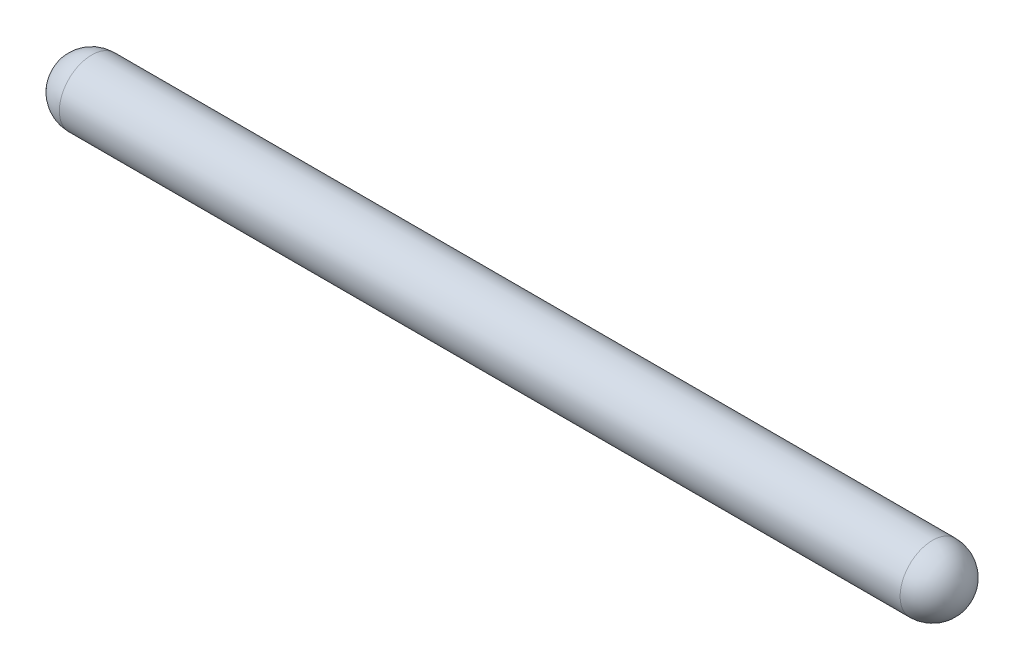
ISO-10303-21;
HEADER;
FILE_DESCRIPTION(('STEP AP214'),'2;1');
FILE_NAME('part.step','',(''),(''),'','','');
FILE_SCHEMA(('AUTOMOTIVE_DESIGN { 1 0 10303 214 1 1 1 1 }'));
ENDSEC;
DATA;
#1=APPLICATION_CONTEXT('core data for automotive mechanical design processes');
#2=APPLICATION_PROTOCOL_DEFINITION('international standard','automotive_design',2000,#1);
#3=PRODUCT_CONTEXT('',#1,'mechanical');
#4=PRODUCT('Part','Part','',(#3));
#5=PRODUCT_RELATED_PRODUCT_CATEGORY('part','',(#4));
#6=PRODUCT_DEFINITION_FORMATION('','',#4);
#7=PRODUCT_DEFINITION_CONTEXT('part definition',#1,'design');
#8=PRODUCT_DEFINITION('design','',#6,#7);
#9=PRODUCT_DEFINITION_SHAPE('','',#8);
#10=(LENGTH_UNIT() NAMED_UNIT(*) SI_UNIT(.MILLI.,.METRE.));
#11=(NAMED_UNIT(*) PLANE_ANGLE_UNIT() SI_UNIT($,.RADIAN.));
#12=(NAMED_UNIT(*) SI_UNIT($,.STERADIAN.) SOLID_ANGLE_UNIT());
#13=UNCERTAINTY_MEASURE_WITH_UNIT(LENGTH_MEASURE(1.E-05),#10,'distance_accuracy_value','');
#14=(GEOMETRIC_REPRESENTATION_CONTEXT(3) GLOBAL_UNCERTAINTY_ASSIGNED_CONTEXT((#13)) GLOBAL_UNIT_ASSIGNED_CONTEXT((#10,
#11,#12)) REPRESENTATION_CONTEXT('',''));
#15=CARTESIAN_POINT('',(0.,0.,0.));
#16=DIRECTION('',(0.,0.,1.));
#17=DIRECTION('',(1.,0.,0.));
#18=AXIS2_PLACEMENT_3D('',#15,#16,#17);
#19=CARTESIAN_POINT('',(-29.,0.,0.));
#20=DIRECTION('',(0.,0.,1.));
#21=DIRECTION('',(1.,0.,0.));
#22=AXIS2_PLACEMENT_3D('',#19,#20,#21);
#23=SPHERICAL_SURFACE('',#22,2.49999999999998);
#24=CARTESIAN_POINT('',(-29.,0.,0.));
#25=DIRECTION('',(-1.,0.,0.));
#26=DIRECTION('',(0.,0.,1.));
#27=AXIS2_PLACEMENT_3D('',#24,#25,#26);
#28=SPHERICAL_SURFACE('',#27,2.49999999999998);
#29=CARTESIAN_POINT('',(-29.,0.,0.));
#30=DIRECTION('',(-1.,0.,0.));
#31=DIRECTION('',(0.,0.,1.));
#32=AXIS2_PLACEMENT_3D('',#29,#30,#31);
#33=CIRCLE('',#32,2.49999999999998);
#34=CARTESIAN_POINT('',(-29.,0.,2.49999999999998));
#35=VERTEX_POINT('',#34);
#36=EDGE_CURVE('E10',#35,#35,#33,.T.);
#37=ORIENTED_EDGE('',*,*,#36,.T.);
#38=EDGE_LOOP('',(#37));
#39=FACE_BOUND('',#38,.T.);
#40=ADVANCED_FACE('F31',(#39),#28,.T.);
#41=CARTESIAN_POINT('',(-29.,0.,0.));
#42=DIRECTION('',(-1.,0.,0.));
#43=DIRECTION('',(0.,0.,1.));
#44=AXIS2_PLACEMENT_3D('',#41,#42,#43);
#45=CYLINDRICAL_SURFACE('',#44,2.49999999999999);
#46=ORIENTED_EDGE('',*,*,#36,.F.);
#47=EDGE_LOOP('',(#46));
#48=FACE_BOUND('',#47,.T.);
#49=CARTESIAN_POINT('',(36.,0.,0.));
#50=DIRECTION('',(-1.,0.,0.));
#51=DIRECTION('',(0.,0.,1.));
#52=AXIS2_PLACEMENT_3D('',#49,#50,#51);
#53=CIRCLE('',#52,2.5);
#54=CARTESIAN_POINT('',(36.,0.,2.5));
#55=VERTEX_POINT('',#54);
#56=EDGE_CURVE('E37',#55,#55,#53,.T.);
#57=ORIENTED_EDGE('',*,*,#56,.T.);
#58=EDGE_LOOP('',(#57));
#59=FACE_BOUND('',#58,.T.);
#60=ADVANCED_FACE('F43',(#48,#59),#45,.T.);
#61=CARTESIAN_POINT('',(36.,0.,0.));
#62=DIRECTION('',(0.,0.,1.));
#63=DIRECTION('',(1.,0.,0.));
#64=AXIS2_PLACEMENT_3D('',#61,#62,#63);
#65=SPHERICAL_SURFACE('',#64,2.5);
#66=CARTESIAN_POINT('',(36.,0.,0.));
#67=DIRECTION('',(-1.,0.,0.));
#68=DIRECTION('',(0.,0.,1.));
#69=AXIS2_PLACEMENT_3D('',#66,#67,#68);
#70=SPHERICAL_SURFACE('',#69,2.5);
#71=ORIENTED_EDGE('',*,*,#56,.F.);
#72=EDGE_LOOP('',(#71));
#73=FACE_BOUND('',#72,.T.);
#74=ADVANCED_FACE('F45',(#73),#70,.T.);
#75=CLOSED_SHELL('',(#40,#60,#74));
#76=MANIFOLD_SOLID_BREP('B2',#75);
#77=ADVANCED_BREP_SHAPE_REPRESENTATION('',(#18,#76),#14);
#78=SHAPE_DEFINITION_REPRESENTATION(#9,#77);
ENDSEC;
END-ISO-10303-21;
